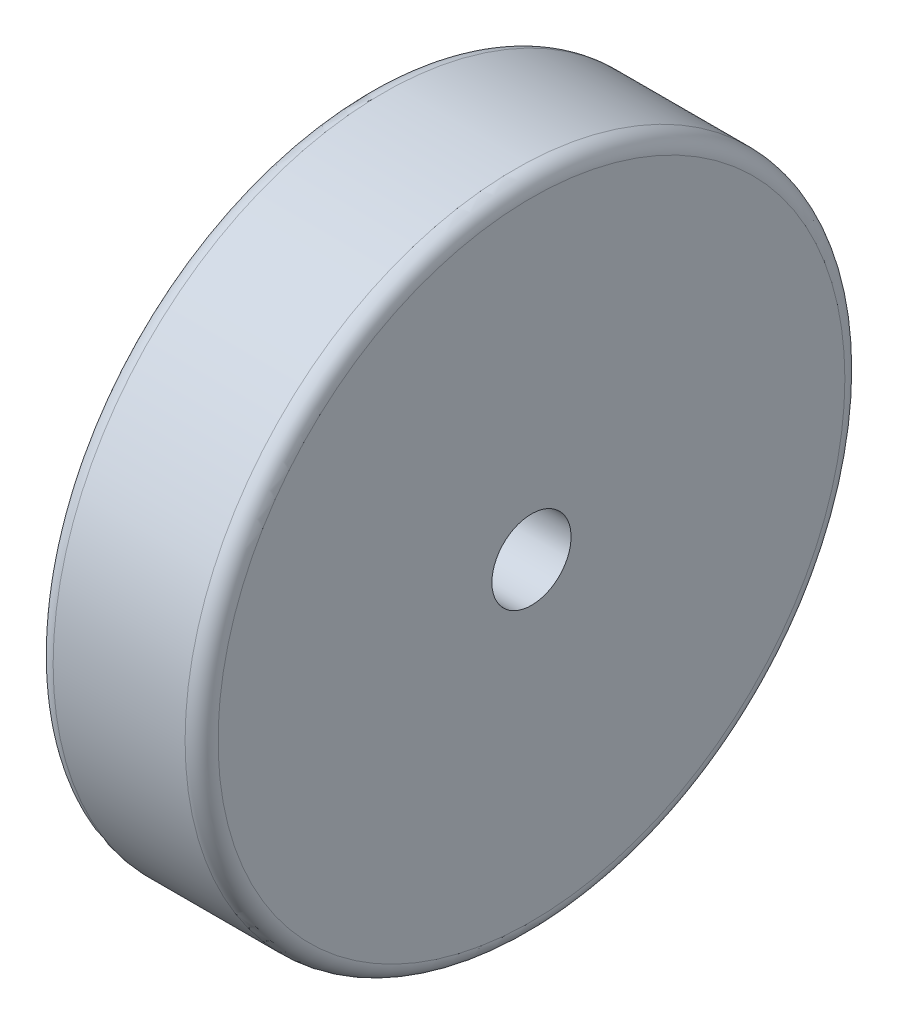
ISO-10303-21;
HEADER;
FILE_DESCRIPTION(('STEP AP214'),'2;1');
FILE_NAME('part.step','',(''),(''),'','','');
FILE_SCHEMA(('AUTOMOTIVE_DESIGN { 1 0 10303 214 1 1 1 1 }'));
ENDSEC;
DATA;
#1=APPLICATION_CONTEXT('core data for automotive mechanical design processes');
#2=APPLICATION_PROTOCOL_DEFINITION('international standard','automotive_design',2000,#1);
#3=PRODUCT_CONTEXT('',#1,'mechanical');
#4=PRODUCT('Part','Part','',(#3));
#5=PRODUCT_RELATED_PRODUCT_CATEGORY('part','',(#4));
#6=PRODUCT_DEFINITION_FORMATION('','',#4);
#7=PRODUCT_DEFINITION_CONTEXT('part definition',#1,'design');
#8=PRODUCT_DEFINITION('design','',#6,#7);
#9=PRODUCT_DEFINITION_SHAPE('','',#8);
#10=(LENGTH_UNIT() NAMED_UNIT(*) SI_UNIT(.MILLI.,.METRE.));
#11=(NAMED_UNIT(*) PLANE_ANGLE_UNIT() SI_UNIT($,.RADIAN.));
#12=(NAMED_UNIT(*) SI_UNIT($,.STERADIAN.) SOLID_ANGLE_UNIT());
#13=UNCERTAINTY_MEASURE_WITH_UNIT(LENGTH_MEASURE(1.E-05),#10,'distance_accuracy_value','');
#14=(GEOMETRIC_REPRESENTATION_CONTEXT(3) GLOBAL_UNCERTAINTY_ASSIGNED_CONTEXT((#13)) GLOBAL_UNIT_ASSIGNED_CONTEXT((#10,
#11,#12)) REPRESENTATION_CONTEXT('',''));
#15=CARTESIAN_POINT('',(0.,0.,0.));
#16=DIRECTION('',(0.,0.,1.));
#17=DIRECTION('',(1.,0.,0.));
#18=AXIS2_PLACEMENT_3D('',#15,#16,#17);
#19=CARTESIAN_POINT('',(-25.,0.,0.));
#20=DIRECTION('',(1.,0.,0.));
#21=DIRECTION('',(0.,0.,-1.));
#22=AXIS2_PLACEMENT_3D('',#19,#20,#21);
#23=CYLINDRICAL_SURFACE('',#22,50.);
#24=CARTESIAN_POINT('',(-2.5,0.,0.));
#25=DIRECTION('',(1.,0.,0.));
#26=DIRECTION('',(0.,0.,-1.));
#27=AXIS2_PLACEMENT_3D('',#24,#25,#26);
#28=CIRCLE('',#27,50.);
#29=CARTESIAN_POINT('',(-2.5,0.,-50.));
#30=VERTEX_POINT('',#29);
#31=EDGE_CURVE('E38',#30,#30,#28,.F.);
#32=ORIENTED_EDGE('',*,*,#31,.T.);
#33=EDGE_LOOP('',(#32));
#34=FACE_BOUND('',#33,.T.);
#35=CARTESIAN_POINT('',(-22.5,0.,0.));
#36=DIRECTION('',(1.,0.,0.));
#37=DIRECTION('',(0.,0.,-1.));
#38=AXIS2_PLACEMENT_3D('',#35,#36,#37);
#39=CIRCLE('',#38,50.);
#40=CARTESIAN_POINT('',(-22.5,0.,-50.));
#41=VERTEX_POINT('',#40);
#42=EDGE_CURVE('E42',#41,#41,#39,.T.);
#43=ORIENTED_EDGE('',*,*,#42,.T.);
#44=EDGE_LOOP('',(#43));
#45=FACE_BOUND('',#44,.T.);
#46=ADVANCED_FACE('F31',(#34,#45),#23,.T.);
#47=CARTESIAN_POINT('',(-25.,0.,0.));
#48=DIRECTION('',(1.,0.,0.));
#49=DIRECTION('',(0.,0.,-1.));
#50=AXIS2_PLACEMENT_3D('',#47,#48,#49);
#51=PLANE('',#50);
#52=CARTESIAN_POINT('',(-25.,0.,0.));
#53=DIRECTION('',(-1.,0.,0.));
#54=DIRECTION('',(0.,0.,1.));
#55=AXIS2_PLACEMENT_3D('',#52,#53,#54);
#56=CIRCLE('',#55,6.);
#57=CARTESIAN_POINT('',(-25.,0.,6.));
#58=VERTEX_POINT('',#57);
#59=EDGE_CURVE('E52',#58,#58,#56,.T.);
#60=ORIENTED_EDGE('',*,*,#59,.F.);
#61=EDGE_LOOP('',(#60));
#62=FACE_BOUND('',#61,.T.);
#63=CARTESIAN_POINT('',(-25.,0.,0.));
#64=DIRECTION('',(1.,0.,0.));
#65=DIRECTION('',(0.,0.,-1.));
#66=AXIS2_PLACEMENT_3D('',#63,#64,#65);
#67=CIRCLE('',#66,47.5);
#68=CARTESIAN_POINT('',(-25.,0.,-47.5));
#69=VERTEX_POINT('',#68);
#70=EDGE_CURVE('E10',#69,#69,#67,.F.);
#71=ORIENTED_EDGE('',*,*,#70,.T.);
#72=EDGE_LOOP('',(#71));
#73=FACE_BOUND('',#72,.T.);
#74=ADVANCED_FACE('F67',(#62,#73),#51,.F.);
#75=CARTESIAN_POINT('',(0.,0.,0.));
#76=DIRECTION('',(1.,0.,0.));
#77=DIRECTION('',(0.,0.,-1.));
#78=AXIS2_PLACEMENT_3D('',#75,#76,#77);
#79=PLANE('',#78);
#80=CARTESIAN_POINT('',(0.,0.,0.));
#81=DIRECTION('',(-1.,0.,0.));
#82=DIRECTION('',(0.,0.,1.));
#83=AXIS2_PLACEMENT_3D('',#80,#81,#82);
#84=CIRCLE('',#83,6.);
#85=CARTESIAN_POINT('',(0.,0.,6.));
#86=VERTEX_POINT('',#85);
#87=EDGE_CURVE('E51',#86,#86,#84,.T.);
#88=ORIENTED_EDGE('',*,*,#87,.T.);
#89=EDGE_LOOP('',(#88));
#90=FACE_BOUND('',#89,.T.);
#91=CARTESIAN_POINT('',(0.,0.,0.));
#92=DIRECTION('',(1.,0.,0.));
#93=DIRECTION('',(0.,0.,-1.));
#94=AXIS2_PLACEMENT_3D('',#91,#92,#93);
#95=CIRCLE('',#94,47.5);
#96=CARTESIAN_POINT('',(0.,0.,-47.5));
#97=VERTEX_POINT('',#96);
#98=EDGE_CURVE('E46',#97,#97,#95,.T.);
#99=ORIENTED_EDGE('',*,*,#98,.T.);
#100=EDGE_LOOP('',(#99));
#101=FACE_BOUND('',#100,.T.);
#102=ADVANCED_FACE('F58',(#90,#101),#79,.T.);
#103=CARTESIAN_POINT('',(-2.5,0.,0.));
#104=DIRECTION('',(1.,0.,0.));
#105=DIRECTION('',(0.,0.,-1.));
#106=AXIS2_PLACEMENT_3D('',#103,#104,#105);
#107=TOROIDAL_SURFACE('',#106,47.5,2.5);
#108=ORIENTED_EDGE('',*,*,#31,.F.);
#109=EDGE_LOOP('',(#108));
#110=FACE_BOUND('',#109,.T.);
#111=ORIENTED_EDGE('',*,*,#98,.F.);
#112=EDGE_LOOP('',(#111));
#113=FACE_BOUND('',#112,.T.);
#114=ADVANCED_FACE('F74',(#110,#113),#107,.T.);
#115=CARTESIAN_POINT('',(-22.5,0.,0.));
#116=DIRECTION('',(1.,0.,0.));
#117=DIRECTION('',(0.,0.,-1.));
#118=AXIS2_PLACEMENT_3D('',#115,#116,#117);
#119=TOROIDAL_SURFACE('',#118,47.5,2.5);
#120=ORIENTED_EDGE('',*,*,#70,.F.);
#121=EDGE_LOOP('',(#120));
#122=FACE_BOUND('',#121,.T.);
#123=ORIENTED_EDGE('',*,*,#42,.F.);
#124=EDGE_LOOP('',(#123));
#125=FACE_BOUND('',#124,.T.);
#126=ADVANCED_FACE('F33',(#122,#125),#119,.T.);
#127=CARTESIAN_POINT('',(0.,0.,0.));
#128=DIRECTION('',(-1.,0.,0.));
#129=DIRECTION('',(0.,0.,1.));
#130=AXIS2_PLACEMENT_3D('',#127,#128,#129);
#131=CYLINDRICAL_SURFACE('',#130,6.);
#132=ORIENTED_EDGE('',*,*,#87,.F.);
#133=EDGE_LOOP('',(#132));
#134=FACE_BOUND('',#133,.T.);
#135=ORIENTED_EDGE('',*,*,#59,.T.);
#136=EDGE_LOOP('',(#135));
#137=FACE_BOUND('',#136,.T.);
#138=ADVANCED_FACE('F61',(#134,#137),#131,.F.);
#139=CLOSED_SHELL('',(#46,#74,#102,#114,#126,#138));
#140=MANIFOLD_SOLID_BREP('B2',#139);
#141=ADVANCED_BREP_SHAPE_REPRESENTATION('',(#18,#140),#14);
#142=SHAPE_DEFINITION_REPRESENTATION(#9,#141);
ENDSEC;
END-ISO-10303-21;
